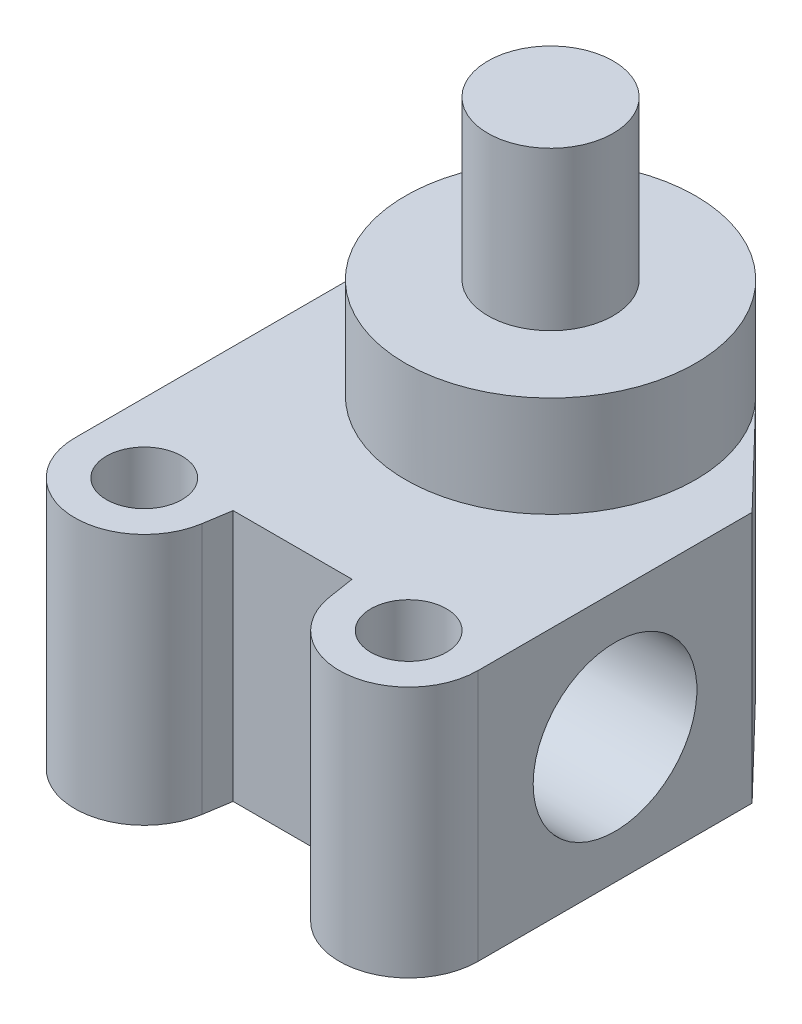
ISO-10303-21;
HEADER;
FILE_DESCRIPTION(('STEP AP214'),'2;1');
FILE_NAME('part.step','',(''),(''),'','','');
FILE_SCHEMA(('AUTOMOTIVE_DESIGN { 1 0 10303 214 1 1 1 1 }'));
ENDSEC;
DATA;
#1=APPLICATION_CONTEXT('core data for automotive mechanical design processes');
#2=APPLICATION_PROTOCOL_DEFINITION('international standard','automotive_design',2000,#1);
#3=PRODUCT_CONTEXT('',#1,'mechanical');
#4=PRODUCT('Part','Part','',(#3));
#5=PRODUCT_RELATED_PRODUCT_CATEGORY('part','',(#4));
#6=PRODUCT_DEFINITION_FORMATION('','',#4);
#7=PRODUCT_DEFINITION_CONTEXT('part definition',#1,'design');
#8=PRODUCT_DEFINITION('design','',#6,#7);
#9=PRODUCT_DEFINITION_SHAPE('','',#8);
#10=(LENGTH_UNIT() NAMED_UNIT(*) SI_UNIT(.MILLI.,.METRE.));
#11=(NAMED_UNIT(*) PLANE_ANGLE_UNIT() SI_UNIT($,.RADIAN.));
#12=(NAMED_UNIT(*) SI_UNIT($,.STERADIAN.) SOLID_ANGLE_UNIT());
#13=UNCERTAINTY_MEASURE_WITH_UNIT(LENGTH_MEASURE(1.E-05),#10,'distance_accuracy_value','');
#14=(GEOMETRIC_REPRESENTATION_CONTEXT(3) GLOBAL_UNCERTAINTY_ASSIGNED_CONTEXT((#13)) GLOBAL_UNIT_ASSIGNED_CONTEXT((#10,
#11,#12)) REPRESENTATION_CONTEXT('',''));
#15=CARTESIAN_POINT('',(0.,0.,0.));
#16=DIRECTION('',(0.,0.,1.));
#17=DIRECTION('',(1.,0.,0.));
#18=AXIS2_PLACEMENT_3D('',#15,#16,#17);
#19=CARTESIAN_POINT('',(0.,31.75,0.));
#20=DIRECTION('',(0.,-1.,0.));
#21=DIRECTION('',(0.,0.,-1.));
#22=AXIS2_PLACEMENT_3D('',#19,#20,#21);
#23=PLANE('',#22);
#24=DIRECTION('',(-0.693974062915899,0.,-0.72));
#25=VECTOR('',#24,1.);
#26=CARTESIAN_POINT('',(13.16736,31.75,-12.691397662606));
#27=LINE('',#26,#25);
#28=CARTESIAN_POINT('',(25.4,31.75,0.));
#29=VERTEX_POINT('',#28);
#30=CARTESIAN_POINT('',(13.16736,31.75,-12.691397662606));
#31=VERTEX_POINT('',#30);
#32=EDGE_CURVE('E50',#29,#31,#27,.T.);
#33=ORIENTED_EDGE('',*,*,#32,.T.);
#34=CARTESIAN_POINT('',(0.,31.75,0.));
#35=DIRECTION('',(0.,-1.,0.));
#36=DIRECTION('',(0.,0.,-1.));
#37=AXIS2_PLACEMENT_3D('',#34,#35,#36);
#38=CIRCLE('',#37,18.288);
#39=CARTESIAN_POINT('',(-13.16736,31.75,-12.691397662606));
#40=VERTEX_POINT('',#39);
#41=EDGE_CURVE('E256',#31,#40,#38,.T.);
#42=ORIENTED_EDGE('',*,*,#41,.T.);
#43=DIRECTION('',(-0.693974062915899,0.,0.72));
#44=VECTOR('',#43,1.);
#45=CARTESIAN_POINT('',(-25.4,31.75,0.));
#46=LINE('',#45,#44);
#47=CARTESIAN_POINT('',(-25.4,31.75,0.));
#48=VERTEX_POINT('',#47);
#49=EDGE_CURVE('E99',#40,#48,#46,.T.);
#50=ORIENTED_EDGE('',*,*,#49,.T.);
#51=DIRECTION('',(0.,0.,1.));
#52=VECTOR('',#51,1.);
#53=CARTESIAN_POINT('',(-25.4,31.75,0.));
#54=LINE('',#53,#52);
#55=CARTESIAN_POINT('',(-25.4,31.75,34.544));
#56=VERTEX_POINT('',#55);
#57=EDGE_CURVE('E274',#48,#56,#54,.T.);
#58=ORIENTED_EDGE('',*,*,#57,.T.);
#59=CARTESIAN_POINT('',(-16.6624,31.75,34.544));
#60=DIRECTION('',(0.,1.,0.));
#61=DIRECTION('',(0.,0.,1.));
#62=AXIS2_PLACEMENT_3D('',#59,#60,#61);
#63=CIRCLE('',#62,8.7376);
#64=CARTESIAN_POINT('',(-8.03278552825222,31.75,35.9134553037618));
#65=VERTEX_POINT('',#64);
#66=EDGE_CURVE('E276',#56,#65,#63,.T.);
#67=ORIENTED_EDGE('',*,*,#66,.T.);
#68=DIRECTION('',(0.156731288198342,0.,-0.987641282703234));
#69=VECTOR('',#68,1.);
#70=CARTESIAN_POINT('',(-8.03278552825223,31.75,35.9134553037618));
#71=LINE('',#70,#69);
#72=CARTESIAN_POINT('',(-7.493,31.75,32.512));
#73=VERTEX_POINT('',#72);
#74=EDGE_CURVE('E278',#65,#73,#71,.T.);
#75=ORIENTED_EDGE('',*,*,#74,.T.);
#76=DIRECTION('',(1.,0.,0.));
#77=VECTOR('',#76,1.);
#78=CARTESIAN_POINT('',(-7.493,31.75,32.512));
#79=LINE('',#78,#77);
#80=CARTESIAN_POINT('',(7.493,31.75,32.512));
#81=VERTEX_POINT('',#80);
#82=EDGE_CURVE('E280',#73,#81,#79,.T.);
#83=ORIENTED_EDGE('',*,*,#82,.T.);
#84=DIRECTION('',(0.156731288198342,0.,0.987641282703234));
#85=VECTOR('',#84,1.);
#86=CARTESIAN_POINT('',(8.03278552825223,31.75,35.9134553037618));
#87=LINE('',#86,#85);
#88=CARTESIAN_POINT('',(8.03278552825223,31.75,35.9134553037618));
#89=VERTEX_POINT('',#88);
#90=EDGE_CURVE('E123',#81,#89,#87,.T.);
#91=ORIENTED_EDGE('',*,*,#90,.T.);
#92=CARTESIAN_POINT('',(16.6624,31.75,34.544));
#93=DIRECTION('',(0.,1.,0.));
#94=DIRECTION('',(0.,0.,1.));
#95=AXIS2_PLACEMENT_3D('',#92,#93,#94);
#96=CIRCLE('',#95,8.7376);
#97=CARTESIAN_POINT('',(25.4,31.75,34.544));
#98=VERTEX_POINT('',#97);
#99=EDGE_CURVE('E117',#89,#98,#96,.T.);
#100=ORIENTED_EDGE('',*,*,#99,.T.);
#101=DIRECTION('',(0.,0.,-1.));
#102=VECTOR('',#101,1.);
#103=CARTESIAN_POINT('',(25.4,31.75,0.));
#104=LINE('',#103,#102);
#105=EDGE_CURVE('E121',#98,#29,#104,.T.);
#106=ORIENTED_EDGE('',*,*,#105,.T.);
#107=EDGE_LOOP('',(#33,#42,#50,#58,#67,#75,#83,#91,#100,#106));
#108=FACE_BOUND('',#107,.T.);
#109=CARTESIAN_POINT('',(16.6624,31.75,34.544));
#110=DIRECTION('',(0.,1.,0.));
#111=DIRECTION('',(0.,0.,1.));
#112=AXIS2_PLACEMENT_3D('',#109,#110,#111);
#113=CIRCLE('',#112,4.7625);
#114=CARTESIAN_POINT('',(16.6624,31.75,39.3065));
#115=VERTEX_POINT('',#114);
#116=EDGE_CURVE('E145',#115,#115,#113,.T.);
#117=ORIENTED_EDGE('',*,*,#116,.F.);
#118=EDGE_LOOP('',(#117));
#119=FACE_BOUND('',#118,.T.);
#120=CARTESIAN_POINT('',(-16.6624,31.75,34.544));
#121=DIRECTION('',(0.,1.,0.));
#122=DIRECTION('',(0.,0.,1.));
#123=AXIS2_PLACEMENT_3D('',#120,#121,#122);
#124=CIRCLE('',#123,4.7625);
#125=CARTESIAN_POINT('',(-16.6624,31.75,39.3065));
#126=VERTEX_POINT('',#125);
#127=EDGE_CURVE('E263',#126,#126,#124,.T.);
#128=ORIENTED_EDGE('',*,*,#127,.F.);
#129=EDGE_LOOP('',(#128));
#130=FACE_BOUND('',#129,.T.);
#131=ADVANCED_FACE('F33',(#108,#119,#130),#23,.F.);
#132=CARTESIAN_POINT('',(0.,0.,0.));
#133=DIRECTION('',(0.,-1.,0.));
#134=DIRECTION('',(0.,0.,-1.));
#135=AXIS2_PLACEMENT_3D('',#132,#133,#134);
#136=PLANE('',#135);
#137=CARTESIAN_POINT('',(0.,0.,0.));
#138=DIRECTION('',(0.,-1.,0.));
#139=DIRECTION('',(0.,0.,-1.));
#140=AXIS2_PLACEMENT_3D('',#137,#138,#139);
#141=CIRCLE('',#140,12.7);
#142=CARTESIAN_POINT('',(0.,0.,-12.7));
#143=VERTEX_POINT('',#142);
#144=EDGE_CURVE('E329',#143,#143,#141,.T.);
#145=ORIENTED_EDGE('',*,*,#144,.F.);
#146=EDGE_LOOP('',(#145));
#147=FACE_BOUND('',#146,.T.);
#148=DIRECTION('',(-0.693974062915899,0.,0.72));
#149=VECTOR('',#148,1.);
#150=CARTESIAN_POINT('',(-25.4,0.,0.));
#151=LINE('',#150,#149);
#152=CARTESIAN_POINT('',(-13.16736,0.,-12.691397662606));
#153=VERTEX_POINT('',#152);
#154=CARTESIAN_POINT('',(-25.4,0.,0.));
#155=VERTEX_POINT('',#154);
#156=EDGE_CURVE('E144',#153,#155,#151,.T.);
#157=ORIENTED_EDGE('',*,*,#156,.F.);
#158=CARTESIAN_POINT('',(0.,0.,0.));
#159=DIRECTION('',(0.,1.,0.));
#160=DIRECTION('',(0.,0.,-1.));
#161=AXIS2_PLACEMENT_3D('',#158,#159,#160);
#162=CIRCLE('',#161,18.288);
#163=CARTESIAN_POINT('',(13.16736,0.,-12.691397662606));
#164=VERTEX_POINT('',#163);
#165=EDGE_CURVE('E141',#164,#153,#162,.T.);
#166=ORIENTED_EDGE('',*,*,#165,.F.);
#167=DIRECTION('',(-0.693974062915899,0.,-0.72));
#168=VECTOR('',#167,1.);
#169=CARTESIAN_POINT('',(13.16736,0.,-12.691397662606));
#170=LINE('',#169,#168);
#171=CARTESIAN_POINT('',(25.4,0.,0.));
#172=VERTEX_POINT('',#171);
#173=EDGE_CURVE('E92',#172,#164,#170,.T.);
#174=ORIENTED_EDGE('',*,*,#173,.F.);
#175=DIRECTION('',(0.,0.,-1.));
#176=VECTOR('',#175,1.);
#177=CARTESIAN_POINT('',(25.4,0.,0.));
#178=LINE('',#177,#176);
#179=CARTESIAN_POINT('',(25.4,0.,34.544));
#180=VERTEX_POINT('',#179);
#181=EDGE_CURVE('E86',#180,#172,#178,.T.);
#182=ORIENTED_EDGE('',*,*,#181,.F.);
#183=CARTESIAN_POINT('',(16.6624,0.,34.544));
#184=DIRECTION('',(0.,1.,0.));
#185=DIRECTION('',(0.,0.,1.));
#186=AXIS2_PLACEMENT_3D('',#183,#184,#185);
#187=CIRCLE('',#186,8.7376);
#188=CARTESIAN_POINT('',(8.03278552825223,0.,35.9134553037618));
#189=VERTEX_POINT('',#188);
#190=EDGE_CURVE('E131',#189,#180,#187,.T.);
#191=ORIENTED_EDGE('',*,*,#190,.F.);
#192=DIRECTION('',(0.156731288198342,0.,0.987641282703234));
#193=VECTOR('',#192,1.);
#194=CARTESIAN_POINT('',(8.03278552825223,0.,35.9134553037618));
#195=LINE('',#194,#193);
#196=CARTESIAN_POINT('',(7.493,0.,32.512));
#197=VERTEX_POINT('',#196);
#198=EDGE_CURVE('E155',#197,#189,#195,.T.);
#199=ORIENTED_EDGE('',*,*,#198,.F.);
#200=DIRECTION('',(1.,0.,0.));
#201=VECTOR('',#200,1.);
#202=CARTESIAN_POINT('',(-7.493,0.,32.512));
#203=LINE('',#202,#201);
#204=CARTESIAN_POINT('',(-7.493,0.,32.512));
#205=VERTEX_POINT('',#204);
#206=EDGE_CURVE('E153',#205,#197,#203,.T.);
#207=ORIENTED_EDGE('',*,*,#206,.F.);
#208=DIRECTION('',(0.156731288198342,0.,-0.987641282703234));
#209=VECTOR('',#208,1.);
#210=CARTESIAN_POINT('',(-8.03278552825223,0.,35.9134553037618));
#211=LINE('',#210,#209);
#212=CARTESIAN_POINT('',(-8.03278552825222,0.,35.9134553037618));
#213=VERTEX_POINT('',#212);
#214=EDGE_CURVE('E151',#213,#205,#211,.T.);
#215=ORIENTED_EDGE('',*,*,#214,.F.);
#216=CARTESIAN_POINT('',(-16.6624,0.,34.544));
#217=DIRECTION('',(0.,1.,0.));
#218=DIRECTION('',(0.,0.,1.));
#219=AXIS2_PLACEMENT_3D('',#216,#217,#218);
#220=CIRCLE('',#219,8.7376);
#221=CARTESIAN_POINT('',(-25.4,0.,34.544));
#222=VERTEX_POINT('',#221);
#223=EDGE_CURVE('E149',#222,#213,#220,.T.);
#224=ORIENTED_EDGE('',*,*,#223,.F.);
#225=DIRECTION('',(0.,0.,1.));
#226=VECTOR('',#225,1.);
#227=CARTESIAN_POINT('',(-25.4,0.,0.));
#228=LINE('',#227,#226);
#229=EDGE_CURVE('E147',#155,#222,#228,.T.);
#230=ORIENTED_EDGE('',*,*,#229,.F.);
#231=EDGE_LOOP('',(#157,#166,#174,#182,#191,#199,#207,#215,#224,#230));
#232=FACE_BOUND('',#231,.T.);
#233=CARTESIAN_POINT('',(16.6624,0.,34.544));
#234=DIRECTION('',(0.,1.,0.));
#235=DIRECTION('',(0.,0.,1.));
#236=AXIS2_PLACEMENT_3D('',#233,#234,#235);
#237=CIRCLE('',#236,4.7625);
#238=CARTESIAN_POINT('',(16.6624,0.,39.3065));
#239=VERTEX_POINT('',#238);
#240=EDGE_CURVE('E266',#239,#239,#237,.T.);
#241=ORIENTED_EDGE('',*,*,#240,.T.);
#242=EDGE_LOOP('',(#241));
#243=FACE_BOUND('',#242,.T.);
#244=CARTESIAN_POINT('',(-16.6624,0.,34.544));
#245=DIRECTION('',(0.,1.,0.));
#246=DIRECTION('',(0.,0.,1.));
#247=AXIS2_PLACEMENT_3D('',#244,#245,#246);
#248=CIRCLE('',#247,4.7625);
#249=CARTESIAN_POINT('',(-16.6624,0.,39.3065));
#250=VERTEX_POINT('',#249);
#251=EDGE_CURVE('E258',#250,#250,#248,.T.);
#252=ORIENTED_EDGE('',*,*,#251,.T.);
#253=EDGE_LOOP('',(#252));
#254=FACE_BOUND('',#253,.T.);
#255=ADVANCED_FACE('F203',(#147,#232,#243,#254),#136,.T.);
#256=CARTESIAN_POINT('',(0.,31.75,0.));
#257=DIRECTION('',(0.,-1.,0.));
#258=DIRECTION('',(0.,0.,-1.));
#259=AXIS2_PLACEMENT_3D('',#256,#257,#258);
#260=CYLINDRICAL_SURFACE('',#259,18.288);
#261=ORIENTED_EDGE('',*,*,#165,.T.);
#262=DIRECTION('',(0.,-1.,0.));
#263=VECTOR('',#262,1.);
#264=CARTESIAN_POINT('',(-13.16736,31.75,-12.691397662606));
#265=LINE('',#264,#263);
#266=EDGE_CURVE('E178',#40,#153,#265,.T.);
#267=ORIENTED_EDGE('',*,*,#266,.F.);
#268=ORIENTED_EDGE('',*,*,#41,.F.);
#269=DIRECTION('',(0.,-1.,0.));
#270=VECTOR('',#269,1.);
#271=CARTESIAN_POINT('',(13.16736,31.75,-12.691397662606));
#272=LINE('',#271,#270);
#273=EDGE_CURVE('E137',#31,#164,#272,.T.);
#274=ORIENTED_EDGE('',*,*,#273,.T.);
#275=EDGE_LOOP('',(#261,#267,#268,#274));
#276=FACE_BOUND('',#275,.T.);
#277=CARTESIAN_POINT('',(0.,44.45,0.));
#278=DIRECTION('',(0.,-1.,0.));
#279=DIRECTION('',(0.,0.,-1.));
#280=AXIS2_PLACEMENT_3D('',#277,#278,#279);
#281=CIRCLE('',#280,18.288);
#282=CARTESIAN_POINT('',(0.,44.45,-18.288));
#283=VERTEX_POINT('',#282);
#284=EDGE_CURVE('E183',#283,#283,#281,.T.);
#285=ORIENTED_EDGE('',*,*,#284,.T.);
#286=EDGE_LOOP('',(#285));
#287=FACE_BOUND('',#286,.T.);
#288=ADVANCED_FACE('F208',(#276,#287),#260,.T.);
#289=CARTESIAN_POINT('',(-25.4,31.75,0.));
#290=DIRECTION('',(0.72,0.,0.693974062915899));
#291=DIRECTION('',(0.693974062915899,0.,-0.72));
#292=AXIS2_PLACEMENT_3D('',#289,#290,#291);
#293=PLANE('',#292);
#294=ORIENTED_EDGE('',*,*,#156,.T.);
#295=DIRECTION('',(0.,-1.,0.));
#296=VECTOR('',#295,1.);
#297=CARTESIAN_POINT('',(-25.4,31.75,0.));
#298=LINE('',#297,#296);
#299=EDGE_CURVE('E175',#48,#155,#298,.T.);
#300=ORIENTED_EDGE('',*,*,#299,.F.);
#301=ORIENTED_EDGE('',*,*,#49,.F.);
#302=ORIENTED_EDGE('',*,*,#266,.T.);
#303=EDGE_LOOP('',(#294,#300,#301,#302));
#304=FACE_BOUND('',#303,.T.);
#305=ADVANCED_FACE('F242',(#304),#293,.F.);
#306=CARTESIAN_POINT('',(-25.4,31.75,0.));
#307=DIRECTION('',(1.,0.,0.));
#308=DIRECTION('',(0.,0.,-1.));
#309=AXIS2_PLACEMENT_3D('',#306,#307,#308);
#310=PLANE('',#309);
#311=CARTESIAN_POINT('',(-25.4,15.875,17.272));
#312=DIRECTION('',(-1.,0.,0.));
#313=DIRECTION('',(0.,0.,1.));
#314=AXIS2_PLACEMENT_3D('',#311,#312,#313);
#315=CIRCLE('',#314,10.31875);
#316=CARTESIAN_POINT('',(-25.4,15.875,27.59075));
#317=VERTEX_POINT('',#316);
#318=EDGE_CURVE('E333',#317,#317,#315,.T.);
#319=ORIENTED_EDGE('',*,*,#318,.F.);
#320=EDGE_LOOP('',(#319));
#321=FACE_BOUND('',#320,.T.);
#322=ORIENTED_EDGE('',*,*,#229,.T.);
#323=DIRECTION('',(0.,-1.,0.));
#324=VECTOR('',#323,1.);
#325=CARTESIAN_POINT('',(-25.4,31.75,34.544));
#326=LINE('',#325,#324);
#327=EDGE_CURVE('E172',#56,#222,#326,.T.);
#328=ORIENTED_EDGE('',*,*,#327,.F.);
#329=ORIENTED_EDGE('',*,*,#57,.F.);
#330=ORIENTED_EDGE('',*,*,#299,.T.);
#331=EDGE_LOOP('',(#322,#328,#329,#330));
#332=FACE_BOUND('',#331,.T.);
#333=ADVANCED_FACE('F238',(#321,#332),#310,.F.);
#334=CARTESIAN_POINT('',(-16.6624,31.75,34.544));
#335=DIRECTION('',(0.,-1.,0.));
#336=DIRECTION('',(0.,0.,-1.));
#337=AXIS2_PLACEMENT_3D('',#334,#335,#336);
#338=CYLINDRICAL_SURFACE('',#337,8.7376);
#339=ORIENTED_EDGE('',*,*,#223,.T.);
#340=DIRECTION('',(0.,-1.,0.));
#341=VECTOR('',#340,1.);
#342=CARTESIAN_POINT('',(-8.03278552825222,31.75,35.9134553037618));
#343=LINE('',#342,#341);
#344=EDGE_CURVE('E169',#65,#213,#343,.T.);
#345=ORIENTED_EDGE('',*,*,#344,.F.);
#346=ORIENTED_EDGE('',*,*,#66,.F.);
#347=ORIENTED_EDGE('',*,*,#327,.T.);
#348=EDGE_LOOP('',(#339,#345,#346,#347));
#349=FACE_BOUND('',#348,.T.);
#350=ADVANCED_FACE('F234',(#349),#338,.T.);
#351=CARTESIAN_POINT('',(-8.03278552825223,31.75,35.9134553037618));
#352=DIRECTION('',(-0.987641282703233,0.,-0.156731288198342));
#353=DIRECTION('',(-0.156731288198342,0.,0.987641282703234));
#354=AXIS2_PLACEMENT_3D('',#351,#352,#353);
#355=PLANE('',#354);
#356=ORIENTED_EDGE('',*,*,#214,.T.);
#357=DIRECTION('',(0.,-1.,0.));
#358=VECTOR('',#357,1.);
#359=CARTESIAN_POINT('',(-7.493,31.75,32.512));
#360=LINE('',#359,#358);
#361=EDGE_CURVE('E166',#73,#205,#360,.T.);
#362=ORIENTED_EDGE('',*,*,#361,.F.);
#363=ORIENTED_EDGE('',*,*,#74,.F.);
#364=ORIENTED_EDGE('',*,*,#344,.T.);
#365=EDGE_LOOP('',(#356,#362,#363,#364));
#366=FACE_BOUND('',#365,.T.);
#367=ADVANCED_FACE('F230',(#366),#355,.F.);
#368=CARTESIAN_POINT('',(-7.493,31.75,32.512));
#369=DIRECTION('',(0.,0.,-1.));
#370=DIRECTION('',(-1.,0.,0.));
#371=AXIS2_PLACEMENT_3D('',#368,#369,#370);
#372=PLANE('',#371);
#373=ORIENTED_EDGE('',*,*,#206,.T.);
#374=DIRECTION('',(0.,-1.,0.));
#375=VECTOR('',#374,1.);
#376=CARTESIAN_POINT('',(7.493,31.75,32.512));
#377=LINE('',#376,#375);
#378=EDGE_CURVE('E163',#81,#197,#377,.T.);
#379=ORIENTED_EDGE('',*,*,#378,.F.);
#380=ORIENTED_EDGE('',*,*,#82,.F.);
#381=ORIENTED_EDGE('',*,*,#361,.T.);
#382=EDGE_LOOP('',(#373,#379,#380,#381));
#383=FACE_BOUND('',#382,.T.);
#384=ADVANCED_FACE('F226',(#383),#372,.F.);
#385=CARTESIAN_POINT('',(8.03278552825223,31.75,35.9134553037618));
#386=DIRECTION('',(0.987641282703233,0.,-0.156731288198342));
#387=DIRECTION('',(-0.156731288198342,0.,-0.987641282703234));
#388=AXIS2_PLACEMENT_3D('',#385,#386,#387);
#389=PLANE('',#388);
#390=ORIENTED_EDGE('',*,*,#198,.T.);
#391=DIRECTION('',(0.,-1.,0.));
#392=VECTOR('',#391,1.);
#393=CARTESIAN_POINT('',(8.03278552825223,31.75,35.9134553037618));
#394=LINE('',#393,#392);
#395=EDGE_CURVE('E132',#89,#189,#394,.T.);
#396=ORIENTED_EDGE('',*,*,#395,.F.);
#397=ORIENTED_EDGE('',*,*,#90,.F.);
#398=ORIENTED_EDGE('',*,*,#378,.T.);
#399=EDGE_LOOP('',(#390,#396,#397,#398));
#400=FACE_BOUND('',#399,.T.);
#401=ADVANCED_FACE('F223',(#400),#389,.F.);
#402=CARTESIAN_POINT('',(16.6624,31.75,34.544));
#403=DIRECTION('',(0.,-1.,0.));
#404=DIRECTION('',(0.,0.,-1.));
#405=AXIS2_PLACEMENT_3D('',#402,#403,#404);
#406=CYLINDRICAL_SURFACE('',#405,8.7376);
#407=ORIENTED_EDGE('',*,*,#190,.T.);
#408=DIRECTION('',(0.,-1.,0.));
#409=VECTOR('',#408,1.);
#410=CARTESIAN_POINT('',(25.4,31.75,34.544));
#411=LINE('',#410,#409);
#412=EDGE_CURVE('E128',#98,#180,#411,.T.);
#413=ORIENTED_EDGE('',*,*,#412,.F.);
#414=ORIENTED_EDGE('',*,*,#99,.F.);
#415=ORIENTED_EDGE('',*,*,#395,.T.);
#416=EDGE_LOOP('',(#407,#413,#414,#415));
#417=FACE_BOUND('',#416,.T.);
#418=ADVANCED_FACE('F129',(#417),#406,.T.);
#419=CARTESIAN_POINT('',(25.4,31.75,0.));
#420=DIRECTION('',(-1.,0.,0.));
#421=DIRECTION('',(0.,0.,1.));
#422=AXIS2_PLACEMENT_3D('',#419,#420,#421);
#423=PLANE('',#422);
#424=CARTESIAN_POINT('',(25.4,15.875,17.272));
#425=DIRECTION('',(-1.,0.,0.));
#426=DIRECTION('',(0.,0.,1.));
#427=AXIS2_PLACEMENT_3D('',#424,#425,#426);
#428=CIRCLE('',#427,10.31875);
#429=CARTESIAN_POINT('',(25.4,15.875,27.59075));
#430=VERTEX_POINT('',#429);
#431=EDGE_CURVE('E330',#430,#430,#428,.T.);
#432=ORIENTED_EDGE('',*,*,#431,.T.);
#433=EDGE_LOOP('',(#432));
#434=FACE_BOUND('',#433,.T.);
#435=ORIENTED_EDGE('',*,*,#181,.T.);
#436=DIRECTION('',(0.,-1.,0.));
#437=VECTOR('',#436,1.);
#438=CARTESIAN_POINT('',(25.4,31.75,0.));
#439=LINE('',#438,#437);
#440=EDGE_CURVE('E133',#29,#172,#439,.T.);
#441=ORIENTED_EDGE('',*,*,#440,.F.);
#442=ORIENTED_EDGE('',*,*,#105,.F.);
#443=ORIENTED_EDGE('',*,*,#412,.T.);
#444=EDGE_LOOP('',(#435,#441,#442,#443));
#445=FACE_BOUND('',#444,.T.);
#446=ADVANCED_FACE('F135',(#434,#445),#423,.F.);
#447=CARTESIAN_POINT('',(13.16736,31.75,-12.691397662606));
#448=DIRECTION('',(-0.72,0.,0.693974062915899));
#449=DIRECTION('',(0.693974062915899,0.,0.72));
#450=AXIS2_PLACEMENT_3D('',#447,#448,#449);
#451=PLANE('',#450);
#452=ORIENTED_EDGE('',*,*,#173,.T.);
#453=ORIENTED_EDGE('',*,*,#273,.F.);
#454=ORIENTED_EDGE('',*,*,#32,.F.);
#455=ORIENTED_EDGE('',*,*,#440,.T.);
#456=EDGE_LOOP('',(#452,#453,#454,#455));
#457=FACE_BOUND('',#456,.T.);
#458=ADVANCED_FACE('F215',(#457),#451,.F.);
#459=CARTESIAN_POINT('',(16.6624,31.75,34.544));
#460=DIRECTION('',(0.,-1.,0.));
#461=DIRECTION('',(0.,0.,-1.));
#462=AXIS2_PLACEMENT_3D('',#459,#460,#461);
#463=CYLINDRICAL_SURFACE('',#462,4.7625);
#464=ORIENTED_EDGE('',*,*,#116,.T.);
#465=EDGE_LOOP('',(#464));
#466=FACE_BOUND('',#465,.T.);
#467=ORIENTED_EDGE('',*,*,#240,.F.);
#468=EDGE_LOOP('',(#467));
#469=FACE_BOUND('',#468,.T.);
#470=ADVANCED_FACE('F212',(#466,#469),#463,.F.);
#471=CARTESIAN_POINT('',(-16.6624,31.75,34.544));
#472=DIRECTION('',(0.,-1.,0.));
#473=DIRECTION('',(0.,0.,-1.));
#474=AXIS2_PLACEMENT_3D('',#471,#472,#473);
#475=CYLINDRICAL_SURFACE('',#474,4.7625);
#476=ORIENTED_EDGE('',*,*,#127,.T.);
#477=EDGE_LOOP('',(#476));
#478=FACE_BOUND('',#477,.T.);
#479=ORIENTED_EDGE('',*,*,#251,.F.);
#480=EDGE_LOOP('',(#479));
#481=FACE_BOUND('',#480,.T.);
#482=ADVANCED_FACE('F302',(#478,#481),#475,.F.);
#483=CARTESIAN_POINT('',(0.,44.45,0.));
#484=DIRECTION('',(0.,-1.,0.));
#485=DIRECTION('',(0.,0.,-1.));
#486=AXIS2_PLACEMENT_3D('',#483,#484,#485);
#487=PLANE('',#486);
#488=CARTESIAN_POINT('',(0.,44.45,0.));
#489=DIRECTION('',(0.,-1.,0.));
#490=DIRECTION('',(0.,0.,-1.));
#491=AXIS2_PLACEMENT_3D('',#488,#489,#490);
#492=CIRCLE('',#491,7.8994);
#493=CARTESIAN_POINT('',(0.,44.45,-7.8994));
#494=VERTEX_POINT('',#493);
#495=EDGE_CURVE('E181',#494,#494,#492,.T.);
#496=ORIENTED_EDGE('',*,*,#495,.T.);
#497=EDGE_LOOP('',(#496));
#498=FACE_BOUND('',#497,.T.);
#499=ORIENTED_EDGE('',*,*,#284,.F.);
#500=EDGE_LOOP('',(#499));
#501=FACE_BOUND('',#500,.T.);
#502=ADVANCED_FACE('F304',(#498,#501),#487,.F.);
#503=CARTESIAN_POINT('',(0.,64.3636,0.));
#504=DIRECTION('',(0.,-1.,0.));
#505=DIRECTION('',(0.,0.,-1.));
#506=AXIS2_PLACEMENT_3D('',#503,#504,#505);
#507=CYLINDRICAL_SURFACE('',#506,7.8994);
#508=CARTESIAN_POINT('',(0.,64.3636,0.));
#509=DIRECTION('',(0.,-1.,0.));
#510=DIRECTION('',(0.,0.,-1.));
#511=AXIS2_PLACEMENT_3D('',#508,#509,#510);
#512=CIRCLE('',#511,7.8994);
#513=CARTESIAN_POINT('',(0.,64.3636,-7.8994));
#514=VERTEX_POINT('',#513);
#515=EDGE_CURVE('E184',#514,#514,#512,.T.);
#516=ORIENTED_EDGE('',*,*,#515,.T.);
#517=EDGE_LOOP('',(#516));
#518=FACE_BOUND('',#517,.T.);
#519=ORIENTED_EDGE('',*,*,#495,.F.);
#520=EDGE_LOOP('',(#519));
#521=FACE_BOUND('',#520,.T.);
#522=ADVANCED_FACE('F310',(#518,#521),#507,.T.);
#523=CARTESIAN_POINT('',(0.,64.3636,0.));
#524=DIRECTION('',(0.,-1.,0.));
#525=DIRECTION('',(0.,0.,-1.));
#526=AXIS2_PLACEMENT_3D('',#523,#524,#525);
#527=PLANE('',#526);
#528=ORIENTED_EDGE('',*,*,#515,.F.);
#529=EDGE_LOOP('',(#528));
#530=FACE_BOUND('',#529,.T.);
#531=ADVANCED_FACE('F317',(#530),#527,.F.);
#532=CARTESIAN_POINT('',(0.,-5.8674,0.));
#533=DIRECTION('',(0.,1.,0.));
#534=DIRECTION('',(0.,0.,1.));
#535=AXIS2_PLACEMENT_3D('',#532,#533,#534);
#536=CYLINDRICAL_SURFACE('',#535,12.7);
#537=CARTESIAN_POINT('',(0.,-2.0574,0.));
#538=DIRECTION('',(0.,-1.,0.));
#539=DIRECTION('',(0.,0.,-1.));
#540=AXIS2_PLACEMENT_3D('',#537,#538,#539);
#541=CIRCLE('',#540,12.7);
#542=CARTESIAN_POINT('',(0.,-2.0574,-12.7));
#543=VERTEX_POINT('',#542);
#544=EDGE_CURVE('E11',#543,#543,#541,.F.);
#545=ORIENTED_EDGE('',*,*,#544,.T.);
#546=EDGE_LOOP('',(#545));
#547=FACE_BOUND('',#546,.T.);
#548=ORIENTED_EDGE('',*,*,#144,.T.);
#549=EDGE_LOOP('',(#548));
#550=FACE_BOUND('',#549,.T.);
#551=ADVANCED_FACE('F199',(#547,#550),#536,.T.);
#552=CARTESIAN_POINT('',(0.,-5.8674,0.));
#553=DIRECTION('',(0.,-1.,0.));
#554=DIRECTION('',(0.,0.,-1.));
#555=AXIS2_PLACEMENT_3D('',#552,#553,#554);
#556=PLANE('',#555);
#557=CARTESIAN_POINT('',(0.,-5.8674,0.));
#558=DIRECTION('',(0.,-1.,0.));
#559=DIRECTION('',(0.,0.,-1.));
#560=AXIS2_PLACEMENT_3D('',#557,#558,#559);
#561=CIRCLE('',#560,8.89);
#562=CARTESIAN_POINT('',(0.,-5.8674,-8.89));
#563=VERTEX_POINT('',#562);
#564=EDGE_CURVE('E42',#563,#563,#561,.T.);
#565=ORIENTED_EDGE('',*,*,#564,.T.);
#566=EDGE_LOOP('',(#565));
#567=FACE_BOUND('',#566,.T.);
#568=ADVANCED_FACE('F188',(#567),#556,.T.);
#569=CARTESIAN_POINT('',(0.,-2.0574,0.));
#570=DIRECTION('',(0.,-1.,0.));
#571=DIRECTION('',(0.,0.,-1.));
#572=AXIS2_PLACEMENT_3D('',#569,#570,#571);
#573=TOROIDAL_SURFACE('',#572,8.89,3.81);
#574=ORIENTED_EDGE('',*,*,#544,.F.);
#575=EDGE_LOOP('',(#574));
#576=FACE_BOUND('',#575,.T.);
#577=ORIENTED_EDGE('',*,*,#564,.F.);
#578=EDGE_LOOP('',(#577));
#579=FACE_BOUND('',#578,.T.);
#580=ADVANCED_FACE('F35',(#576,#579),#573,.T.);
#581=CARTESIAN_POINT('',(25.4,15.875,17.272));
#582=DIRECTION('',(-1.,0.,0.));
#583=DIRECTION('',(0.,0.,1.));
#584=AXIS2_PLACEMENT_3D('',#581,#582,#583);
#585=CYLINDRICAL_SURFACE('',#584,10.31875);
#586=ORIENTED_EDGE('',*,*,#431,.F.);
#587=EDGE_LOOP('',(#586));
#588=FACE_BOUND('',#587,.T.);
#589=ORIENTED_EDGE('',*,*,#318,.T.);
#590=EDGE_LOOP('',(#589));
#591=FACE_BOUND('',#590,.T.);
#592=ADVANCED_FACE('F191',(#588,#591),#585,.F.);
#593=CLOSED_SHELL('',(#131,#255,#288,#305,#333,#350,#367,#384,#401,#418,#446,#458,#470,#482,
#502,#522,#531,#551,#568,#580,#592));
#594=MANIFOLD_SOLID_BREP('B2',#593);
#595=ADVANCED_BREP_SHAPE_REPRESENTATION('',(#18,#594),#14);
#596=SHAPE_DEFINITION_REPRESENTATION(#9,#595);
ENDSEC;
END-ISO-10303-21;
